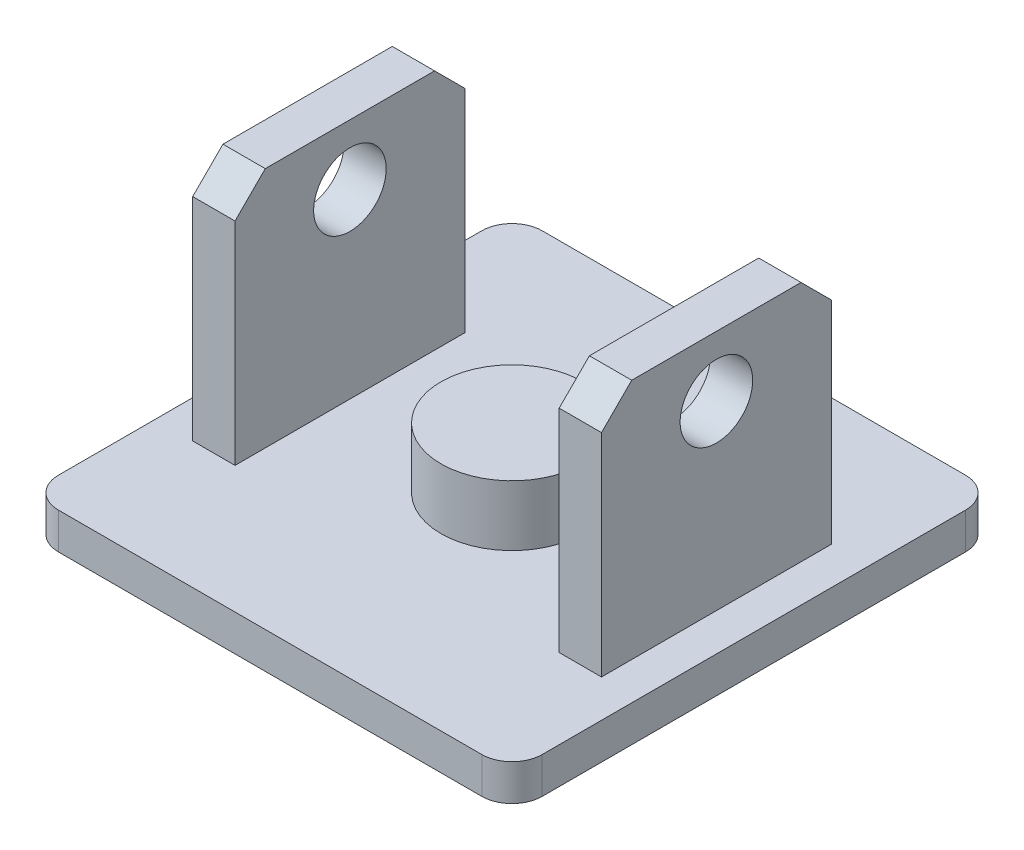
ISO-10303-21;
HEADER;
FILE_DESCRIPTION(('STEP AP214'),'2;1');
FILE_NAME('part.step','',(''),(''),'','','');
FILE_SCHEMA(('AUTOMOTIVE_DESIGN { 1 0 10303 214 1 1 1 1 }'));
ENDSEC;
DATA;
#1=APPLICATION_CONTEXT('core data for automotive mechanical design processes');
#2=APPLICATION_PROTOCOL_DEFINITION('international standard','automotive_design',2000,#1);
#3=PRODUCT_CONTEXT('',#1,'mechanical');
#4=PRODUCT('Part','Part','',(#3));
#5=PRODUCT_RELATED_PRODUCT_CATEGORY('part','',(#4));
#6=PRODUCT_DEFINITION_FORMATION('','',#4);
#7=PRODUCT_DEFINITION_CONTEXT('part definition',#1,'design');
#8=PRODUCT_DEFINITION('design','',#6,#7);
#9=PRODUCT_DEFINITION_SHAPE('','',#8);
#10=(LENGTH_UNIT() NAMED_UNIT(*) SI_UNIT(.MILLI.,.METRE.));
#11=(NAMED_UNIT(*) PLANE_ANGLE_UNIT() SI_UNIT($,.RADIAN.));
#12=(NAMED_UNIT(*) SI_UNIT($,.STERADIAN.) SOLID_ANGLE_UNIT());
#13=UNCERTAINTY_MEASURE_WITH_UNIT(LENGTH_MEASURE(1.E-05),#10,'distance_accuracy_value','');
#14=(GEOMETRIC_REPRESENTATION_CONTEXT(3) GLOBAL_UNCERTAINTY_ASSIGNED_CONTEXT((#13)) GLOBAL_UNIT_ASSIGNED_CONTEXT((#10,
#11,#12)) REPRESENTATION_CONTEXT('',''));
#15=CARTESIAN_POINT('',(0.,0.,0.));
#16=DIRECTION('',(0.,0.,1.));
#17=DIRECTION('',(1.,0.,0.));
#18=AXIS2_PLACEMENT_3D('',#15,#16,#17);
#19=CARTESIAN_POINT('',(0.,3.,0.));
#20=DIRECTION('',(0.,1.,0.));
#21=DIRECTION('',(0.,0.,1.));
#22=AXIS2_PLACEMENT_3D('',#19,#20,#21);
#23=PLANE('',#22);
#24=DIRECTION('',(0.,0.,-1.));
#25=VECTOR('',#24,1.);
#26=CARTESIAN_POINT('',(-16.9,3.,-9.5));
#27=LINE('',#26,#25);
#28=CARTESIAN_POINT('',(-16.9,3.,9.5));
#29=VERTEX_POINT('',#28);
#30=CARTESIAN_POINT('',(-16.9,3.,-9.5));
#31=VERTEX_POINT('',#30);
#32=EDGE_CURVE('E183',#29,#31,#27,.T.);
#33=ORIENTED_EDGE('',*,*,#32,.T.);
#34=DIRECTION('',(1.,0.,0.));
#35=VECTOR('',#34,1.);
#36=CARTESIAN_POINT('',(-13.4,3.,-9.5));
#37=LINE('',#36,#35);
#38=CARTESIAN_POINT('',(-13.4,3.,-9.5));
#39=VERTEX_POINT('',#38);
#40=EDGE_CURVE('E199',#31,#39,#37,.T.);
#41=ORIENTED_EDGE('',*,*,#40,.T.);
#42=DIRECTION('',(0.,0.,1.));
#43=VECTOR('',#42,1.);
#44=CARTESIAN_POINT('',(-13.4,3.,-9.5));
#45=LINE('',#44,#43);
#46=CARTESIAN_POINT('',(-13.4,3.,9.5));
#47=VERTEX_POINT('',#46);
#48=EDGE_CURVE('E208',#39,#47,#45,.T.);
#49=ORIENTED_EDGE('',*,*,#48,.T.);
#50=DIRECTION('',(-1.,0.,0.));
#51=VECTOR('',#50,1.);
#52=CARTESIAN_POINT('',(-13.4,3.,9.5));
#53=LINE('',#52,#51);
#54=EDGE_CURVE('E202',#47,#29,#53,.T.);
#55=ORIENTED_EDGE('',*,*,#54,.T.);
#56=EDGE_LOOP('',(#33,#41,#49,#55));
#57=FACE_BOUND('',#56,.T.);
#58=CARTESIAN_POINT('',(0.,3.,0.));
#59=DIRECTION('',(0.,1.,0.));
#60=DIRECTION('',(0.,0.,1.));
#61=AXIS2_PLACEMENT_3D('',#58,#59,#60);
#62=CIRCLE('',#61,5.875);
#63=CARTESIAN_POINT('',(0.,3.,5.875));
#64=VERTEX_POINT('',#63);
#65=EDGE_CURVE('E255',#64,#64,#62,.T.);
#66=ORIENTED_EDGE('',*,*,#65,.F.);
#67=EDGE_LOOP('',(#66));
#68=FACE_BOUND('',#67,.T.);
#69=DIRECTION('',(1.,0.,0.));
#70=VECTOR('',#69,1.);
#71=CARTESIAN_POINT('',(-20.,3.,20.));
#72=LINE('',#71,#70);
#73=CARTESIAN_POINT('',(-17.5,3.,20.));
#74=VERTEX_POINT('',#73);
#75=CARTESIAN_POINT('',(17.5,3.,20.));
#76=VERTEX_POINT('',#75);
#77=EDGE_CURVE('E259',#74,#76,#72,.T.);
#78=ORIENTED_EDGE('',*,*,#77,.T.);
#79=CARTESIAN_POINT('',(17.5,3.,17.5));
#80=DIRECTION('',(0.,1.,0.));
#81=DIRECTION('',(0.,0.,1.));
#82=AXIS2_PLACEMENT_3D('',#79,#80,#81);
#83=CIRCLE('',#82,2.5);
#84=CARTESIAN_POINT('',(20.,3.,17.5));
#85=VERTEX_POINT('',#84);
#86=EDGE_CURVE('E305',#76,#85,#83,.T.);
#87=ORIENTED_EDGE('',*,*,#86,.T.);
#88=DIRECTION('',(0.,0.,-1.));
#89=VECTOR('',#88,1.);
#90=CARTESIAN_POINT('',(20.,3.,-20.));
#91=LINE('',#90,#89);
#92=CARTESIAN_POINT('',(20.,3.,-17.5));
#93=VERTEX_POINT('',#92);
#94=EDGE_CURVE('E260',#85,#93,#91,.T.);
#95=ORIENTED_EDGE('',*,*,#94,.T.);
#96=CARTESIAN_POINT('',(17.5,3.,-17.5));
#97=DIRECTION('',(0.,1.,0.));
#98=DIRECTION('',(0.,0.,1.));
#99=AXIS2_PLACEMENT_3D('',#96,#97,#98);
#100=CIRCLE('',#99,2.5);
#101=CARTESIAN_POINT('',(17.5,3.,-20.));
#102=VERTEX_POINT('',#101);
#103=EDGE_CURVE('E303',#93,#102,#100,.T.);
#104=ORIENTED_EDGE('',*,*,#103,.T.);
#105=DIRECTION('',(-1.,0.,0.));
#106=VECTOR('',#105,1.);
#107=CARTESIAN_POINT('',(-20.,3.,-20.));
#108=LINE('',#107,#106);
#109=CARTESIAN_POINT('',(-17.5,3.,-20.));
#110=VERTEX_POINT('',#109);
#111=EDGE_CURVE('E263',#102,#110,#108,.T.);
#112=ORIENTED_EDGE('',*,*,#111,.T.);
#113=CARTESIAN_POINT('',(-17.5,3.,-17.5));
#114=DIRECTION('',(0.,1.,0.));
#115=DIRECTION('',(0.,0.,1.));
#116=AXIS2_PLACEMENT_3D('',#113,#114,#115);
#117=CIRCLE('',#116,2.5);
#118=CARTESIAN_POINT('',(-20.,3.,-17.5));
#119=VERTEX_POINT('',#118);
#120=EDGE_CURVE('E299',#110,#119,#117,.T.);
#121=ORIENTED_EDGE('',*,*,#120,.T.);
#122=DIRECTION('',(0.,0.,1.));
#123=VECTOR('',#122,1.);
#124=CARTESIAN_POINT('',(-20.,3.,-20.));
#125=LINE('',#124,#123);
#126=CARTESIAN_POINT('',(-20.,3.,17.5));
#127=VERTEX_POINT('',#126);
#128=EDGE_CURVE('E267',#119,#127,#125,.T.);
#129=ORIENTED_EDGE('',*,*,#128,.T.);
#130=CARTESIAN_POINT('',(-17.5,3.,17.5));
#131=DIRECTION('',(0.,1.,0.));
#132=DIRECTION('',(0.,0.,1.));
#133=AXIS2_PLACEMENT_3D('',#130,#131,#132);
#134=CIRCLE('',#133,2.5);
#135=EDGE_CURVE('E301',#127,#74,#134,.T.);
#136=ORIENTED_EDGE('',*,*,#135,.T.);
#137=EDGE_LOOP('',(#78,#87,#95,#104,#112,#121,#129,#136));
#138=FACE_BOUND('',#137,.T.);
#139=DIRECTION('',(-1.,0.,0.));
#140=VECTOR('',#139,1.);
#141=CARTESIAN_POINT('',(13.4,3.,-9.5));
#142=LINE('',#141,#140);
#143=CARTESIAN_POINT('',(16.9,3.,-9.5));
#144=VERTEX_POINT('',#143);
#145=CARTESIAN_POINT('',(13.4,3.,-9.5));
#146=VERTEX_POINT('',#145);
#147=EDGE_CURVE('E236',#144,#146,#142,.T.);
#148=ORIENTED_EDGE('',*,*,#147,.F.);
#149=DIRECTION('',(0.,0.,-1.));
#150=VECTOR('',#149,1.);
#151=CARTESIAN_POINT('',(16.9,3.,-9.5));
#152=LINE('',#151,#150);
#153=CARTESIAN_POINT('',(16.9,3.,9.5));
#154=VERTEX_POINT('',#153);
#155=EDGE_CURVE('E225',#154,#144,#152,.T.);
#156=ORIENTED_EDGE('',*,*,#155,.F.);
#157=DIRECTION('',(1.,0.,0.));
#158=VECTOR('',#157,1.);
#159=CARTESIAN_POINT('',(13.4,3.,9.5));
#160=LINE('',#159,#158);
#161=CARTESIAN_POINT('',(13.4,3.,9.5));
#162=VERTEX_POINT('',#161);
#163=EDGE_CURVE('E230',#162,#154,#160,.T.);
#164=ORIENTED_EDGE('',*,*,#163,.F.);
#165=DIRECTION('',(0.,0.,1.));
#166=VECTOR('',#165,1.);
#167=CARTESIAN_POINT('',(13.4,3.,-9.5));
#168=LINE('',#167,#166);
#169=EDGE_CURVE('E239',#146,#162,#168,.T.);
#170=ORIENTED_EDGE('',*,*,#169,.F.);
#171=EDGE_LOOP('',(#148,#156,#164,#170));
#172=FACE_BOUND('',#171,.T.);
#173=ADVANCED_FACE('F41',(#57,#68,#138,#172),#23,.T.);
#174=CARTESIAN_POINT('',(20.,3.,-20.));
#175=DIRECTION('',(-1.,0.,0.));
#176=DIRECTION('',(0.,0.,1.));
#177=AXIS2_PLACEMENT_3D('',#174,#175,#176);
#178=PLANE('',#177);
#179=ORIENTED_EDGE('',*,*,#94,.F.);
#180=DIRECTION('',(0.,-1.,0.));
#181=VECTOR('',#180,1.);
#182=CARTESIAN_POINT('',(20.,3.,17.5));
#183=LINE('',#182,#181);
#184=CARTESIAN_POINT('',(20.,0.,17.5));
#185=VERTEX_POINT('',#184);
#186=EDGE_CURVE('E283',#85,#185,#183,.T.);
#187=ORIENTED_EDGE('',*,*,#186,.T.);
#188=DIRECTION('',(0.,0.,-1.));
#189=VECTOR('',#188,1.);
#190=CARTESIAN_POINT('',(20.,0.,-20.));
#191=LINE('',#190,#189);
#192=CARTESIAN_POINT('',(20.,0.,-17.5));
#193=VERTEX_POINT('',#192);
#194=EDGE_CURVE('E254',#185,#193,#191,.T.);
#195=ORIENTED_EDGE('',*,*,#194,.T.);
#196=DIRECTION('',(0.,-1.,0.));
#197=VECTOR('',#196,1.);
#198=CARTESIAN_POINT('',(20.,3.,-17.5));
#199=LINE('',#198,#197);
#200=EDGE_CURVE('E258',#193,#93,#199,.F.);
#201=ORIENTED_EDGE('',*,*,#200,.T.);
#202=EDGE_LOOP('',(#179,#187,#195,#201));
#203=FACE_BOUND('',#202,.T.);
#204=ADVANCED_FACE('F379',(#203),#178,.F.);
#205=CARTESIAN_POINT('',(-20.,3.,-20.));
#206=DIRECTION('',(0.,0.,1.));
#207=DIRECTION('',(1.,0.,0.));
#208=AXIS2_PLACEMENT_3D('',#205,#206,#207);
#209=PLANE('',#208);
#210=ORIENTED_EDGE('',*,*,#111,.F.);
#211=DIRECTION('',(0.,-1.,0.));
#212=VECTOR('',#211,1.);
#213=CARTESIAN_POINT('',(17.5,3.,-20.));
#214=LINE('',#213,#212);
#215=CARTESIAN_POINT('',(17.5,0.,-20.));
#216=VERTEX_POINT('',#215);
#217=EDGE_CURVE('E309',#102,#216,#214,.T.);
#218=ORIENTED_EDGE('',*,*,#217,.T.);
#219=DIRECTION('',(-1.,0.,0.));
#220=VECTOR('',#219,1.);
#221=CARTESIAN_POINT('',(-20.,0.,-20.));
#222=LINE('',#221,#220);
#223=CARTESIAN_POINT('',(-17.5,0.,-20.));
#224=VERTEX_POINT('',#223);
#225=EDGE_CURVE('E274',#216,#224,#222,.T.);
#226=ORIENTED_EDGE('',*,*,#225,.T.);
#227=DIRECTION('',(0.,-1.,0.));
#228=VECTOR('',#227,1.);
#229=CARTESIAN_POINT('',(-17.5,3.,-20.));
#230=LINE('',#229,#228);
#231=EDGE_CURVE('E307',#224,#110,#230,.F.);
#232=ORIENTED_EDGE('',*,*,#231,.T.);
#233=EDGE_LOOP('',(#210,#218,#226,#232));
#234=FACE_BOUND('',#233,.T.);
#235=ADVANCED_FACE('F386',(#234),#209,.F.);
#236=CARTESIAN_POINT('',(-20.,3.,-20.));
#237=DIRECTION('',(1.,0.,0.));
#238=DIRECTION('',(0.,0.,-1.));
#239=AXIS2_PLACEMENT_3D('',#236,#237,#238);
#240=PLANE('',#239);
#241=DIRECTION('',(0.,0.,1.));
#242=VECTOR('',#241,1.);
#243=CARTESIAN_POINT('',(-20.,0.,-20.));
#244=LINE('',#243,#242);
#245=CARTESIAN_POINT('',(-20.,0.,-17.5));
#246=VERTEX_POINT('',#245);
#247=CARTESIAN_POINT('',(-20.,0.,17.5));
#248=VERTEX_POINT('',#247);
#249=EDGE_CURVE('E277',#246,#248,#244,.T.);
#250=ORIENTED_EDGE('',*,*,#249,.T.);
#251=DIRECTION('',(0.,-1.,0.));
#252=VECTOR('',#251,1.);
#253=CARTESIAN_POINT('',(-20.,3.,17.5));
#254=LINE('',#253,#252);
#255=EDGE_CURVE('E315',#248,#127,#254,.F.);
#256=ORIENTED_EDGE('',*,*,#255,.T.);
#257=ORIENTED_EDGE('',*,*,#128,.F.);
#258=DIRECTION('',(0.,-1.,0.));
#259=VECTOR('',#258,1.);
#260=CARTESIAN_POINT('',(-20.,3.,-17.5));
#261=LINE('',#260,#259);
#262=EDGE_CURVE('E312',#119,#246,#261,.T.);
#263=ORIENTED_EDGE('',*,*,#262,.T.);
#264=EDGE_LOOP('',(#250,#256,#257,#263));
#265=FACE_BOUND('',#264,.T.);
#266=ADVANCED_FACE('F400',(#265),#240,.F.);
#267=CARTESIAN_POINT('',(-20.,3.,20.));
#268=DIRECTION('',(0.,0.,-1.));
#269=DIRECTION('',(-1.,0.,0.));
#270=AXIS2_PLACEMENT_3D('',#267,#268,#269);
#271=PLANE('',#270);
#272=DIRECTION('',(1.,0.,0.));
#273=VECTOR('',#272,1.);
#274=CARTESIAN_POINT('',(-20.,0.,20.));
#275=LINE('',#274,#273);
#276=CARTESIAN_POINT('',(-17.5,0.,20.));
#277=VERTEX_POINT('',#276);
#278=CARTESIAN_POINT('',(17.5,0.,20.));
#279=VERTEX_POINT('',#278);
#280=EDGE_CURVE('E264',#277,#279,#275,.T.);
#281=ORIENTED_EDGE('',*,*,#280,.T.);
#282=DIRECTION('',(0.,-1.,0.));
#283=VECTOR('',#282,1.);
#284=CARTESIAN_POINT('',(17.5,3.,20.));
#285=LINE('',#284,#283);
#286=EDGE_CURVE('E297',#279,#76,#285,.F.);
#287=ORIENTED_EDGE('',*,*,#286,.T.);
#288=ORIENTED_EDGE('',*,*,#77,.F.);
#289=DIRECTION('',(0.,-1.,0.));
#290=VECTOR('',#289,1.);
#291=CARTESIAN_POINT('',(-17.5,3.,20.));
#292=LINE('',#291,#290);
#293=EDGE_CURVE('E294',#74,#277,#292,.T.);
#294=ORIENTED_EDGE('',*,*,#293,.T.);
#295=EDGE_LOOP('',(#281,#287,#288,#294));
#296=FACE_BOUND('',#295,.T.);
#297=ADVANCED_FACE('F396',(#296),#271,.F.);
#298=CARTESIAN_POINT('',(0.,0.,0.));
#299=DIRECTION('',(0.,1.,0.));
#300=DIRECTION('',(0.,0.,1.));
#301=AXIS2_PLACEMENT_3D('',#298,#299,#300);
#302=PLANE('',#301);
#303=ORIENTED_EDGE('',*,*,#194,.F.);
#304=CARTESIAN_POINT('',(17.5,0.,17.5));
#305=DIRECTION('',(0.,1.,0.));
#306=DIRECTION('',(0.,0.,1.));
#307=AXIS2_PLACEMENT_3D('',#304,#305,#306);
#308=CIRCLE('',#307,2.5);
#309=EDGE_CURVE('E292',#185,#279,#308,.F.);
#310=ORIENTED_EDGE('',*,*,#309,.T.);
#311=ORIENTED_EDGE('',*,*,#280,.F.);
#312=CARTESIAN_POINT('',(-17.5,0.,17.5));
#313=DIRECTION('',(0.,1.,0.));
#314=DIRECTION('',(0.,0.,1.));
#315=AXIS2_PLACEMENT_3D('',#312,#313,#314);
#316=CIRCLE('',#315,2.5);
#317=EDGE_CURVE('E288',#277,#248,#316,.F.);
#318=ORIENTED_EDGE('',*,*,#317,.T.);
#319=ORIENTED_EDGE('',*,*,#249,.F.);
#320=CARTESIAN_POINT('',(-17.5,0.,-17.5));
#321=DIRECTION('',(0.,1.,0.));
#322=DIRECTION('',(0.,0.,1.));
#323=AXIS2_PLACEMENT_3D('',#320,#321,#322);
#324=CIRCLE('',#323,2.5);
#325=EDGE_CURVE('E286',#246,#224,#324,.F.);
#326=ORIENTED_EDGE('',*,*,#325,.T.);
#327=ORIENTED_EDGE('',*,*,#225,.F.);
#328=CARTESIAN_POINT('',(17.5,0.,-17.5));
#329=DIRECTION('',(0.,1.,0.));
#330=DIRECTION('',(0.,0.,1.));
#331=AXIS2_PLACEMENT_3D('',#328,#329,#330);
#332=CIRCLE('',#331,2.5);
#333=EDGE_CURVE('E290',#216,#193,#332,.F.);
#334=ORIENTED_EDGE('',*,*,#333,.T.);
#335=EDGE_LOOP('',(#303,#310,#311,#318,#319,#326,#327,#334));
#336=FACE_BOUND('',#335,.T.);
#337=ADVANCED_FACE('F393',(#336),#302,.F.);
#338=CARTESIAN_POINT('',(0.,8.,0.));
#339=DIRECTION('',(0.,-1.,0.));
#340=DIRECTION('',(0.,0.,-1.));
#341=AXIS2_PLACEMENT_3D('',#338,#339,#340);
#342=CYLINDRICAL_SURFACE('',#341,5.875);
#343=CARTESIAN_POINT('',(0.,8.,0.));
#344=DIRECTION('',(0.,1.,0.));
#345=DIRECTION('',(0.,0.,1.));
#346=AXIS2_PLACEMENT_3D('',#343,#344,#345);
#347=CIRCLE('',#346,5.875);
#348=CARTESIAN_POINT('',(0.,8.,5.875));
#349=VERTEX_POINT('',#348);
#350=EDGE_CURVE('E251',#349,#349,#347,.T.);
#351=ORIENTED_EDGE('',*,*,#350,.F.);
#352=EDGE_LOOP('',(#351));
#353=FACE_BOUND('',#352,.T.);
#354=ORIENTED_EDGE('',*,*,#65,.T.);
#355=EDGE_LOOP('',(#354));
#356=FACE_BOUND('',#355,.T.);
#357=ADVANCED_FACE('F391',(#353,#356),#342,.T.);
#358=CARTESIAN_POINT('',(0.,8.,0.));
#359=DIRECTION('',(0.,1.,0.));
#360=DIRECTION('',(0.,0.,1.));
#361=AXIS2_PLACEMENT_3D('',#358,#359,#360);
#362=PLANE('',#361);
#363=ORIENTED_EDGE('',*,*,#350,.T.);
#364=EDGE_LOOP('',(#363));
#365=FACE_BOUND('',#364,.T.);
#366=ADVANCED_FACE('F375',(#365),#362,.T.);
#367=CARTESIAN_POINT('',(16.9,23.,-9.5));
#368=DIRECTION('',(-1.,0.,0.));
#369=DIRECTION('',(0.,0.,1.));
#370=AXIS2_PLACEMENT_3D('',#367,#368,#369);
#371=PLANE('',#370);
#372=CARTESIAN_POINT('',(16.9,18.,0.));
#373=DIRECTION('',(1.,0.,0.));
#374=DIRECTION('',(0.,0.,-1.));
#375=AXIS2_PLACEMENT_3D('',#372,#373,#374);
#376=CIRCLE('',#375,3.);
#377=CARTESIAN_POINT('',(16.9,18.,-3.));
#378=VERTEX_POINT('',#377);
#379=EDGE_CURVE('E219',#378,#378,#376,.T.);
#380=ORIENTED_EDGE('',*,*,#379,.F.);
#381=EDGE_LOOP('',(#380));
#382=FACE_BOUND('',#381,.T.);
#383=DIRECTION('',(0.,0.,-1.));
#384=VECTOR('',#383,1.);
#385=CARTESIAN_POINT('',(16.9,23.,-9.5));
#386=LINE('',#385,#384);
#387=CARTESIAN_POINT('',(16.9,23.,7.));
#388=VERTEX_POINT('',#387);
#389=CARTESIAN_POINT('',(16.9,23.,-6.99999999999999));
#390=VERTEX_POINT('',#389);
#391=EDGE_CURVE('E226',#388,#390,#386,.T.);
#392=ORIENTED_EDGE('',*,*,#391,.F.);
#393=DIRECTION('',(0.,-0.707106781186549,0.707106781186546));
#394=VECTOR('',#393,1.);
#395=CARTESIAN_POINT('',(16.9,23.,7.));
#396=LINE('',#395,#394);
#397=CARTESIAN_POINT('',(16.9,20.5,9.5));
#398=VERTEX_POINT('',#397);
#399=EDGE_CURVE('E341',#388,#398,#396,.T.);
#400=ORIENTED_EDGE('',*,*,#399,.T.);
#401=DIRECTION('',(0.,-1.,0.));
#402=VECTOR('',#401,1.);
#403=CARTESIAN_POINT('',(16.9,23.,9.5));
#404=LINE('',#403,#402);
#405=EDGE_CURVE('E233',#398,#154,#404,.T.);
#406=ORIENTED_EDGE('',*,*,#405,.T.);
#407=ORIENTED_EDGE('',*,*,#155,.T.);
#408=DIRECTION('',(0.,-1.,0.));
#409=VECTOR('',#408,1.);
#410=CARTESIAN_POINT('',(16.9,23.,-9.5));
#411=LINE('',#410,#409);
#412=CARTESIAN_POINT('',(16.9,20.5,-9.5));
#413=VERTEX_POINT('',#412);
#414=EDGE_CURVE('E249',#413,#144,#411,.T.);
#415=ORIENTED_EDGE('',*,*,#414,.F.);
#416=DIRECTION('',(0.,0.707106781186549,0.707106781186547));
#417=VECTOR('',#416,1.);
#418=CARTESIAN_POINT('',(16.9,23.,-6.99999999999999));
#419=LINE('',#418,#417);
#420=EDGE_CURVE('E339',#413,#390,#419,.T.);
#421=ORIENTED_EDGE('',*,*,#420,.T.);
#422=EDGE_LOOP('',(#392,#400,#406,#407,#415,#421));
#423=FACE_BOUND('',#422,.T.);
#424=ADVANCED_FACE('F354',(#382,#423),#371,.F.);
#425=CARTESIAN_POINT('',(13.4,23.,-9.5));
#426=DIRECTION('',(0.,0.,1.));
#427=DIRECTION('',(1.,0.,0.));
#428=AXIS2_PLACEMENT_3D('',#425,#426,#427);
#429=PLANE('',#428);
#430=DIRECTION('',(0.,-1.,0.));
#431=VECTOR('',#430,1.);
#432=CARTESIAN_POINT('',(13.4,23.,-9.5));
#433=LINE('',#432,#431);
#434=CARTESIAN_POINT('',(13.4,20.5,-9.5));
#435=VERTEX_POINT('',#434);
#436=EDGE_CURVE('E247',#435,#146,#433,.T.);
#437=ORIENTED_EDGE('',*,*,#436,.F.);
#438=DIRECTION('',(1.,0.,0.));
#439=VECTOR('',#438,1.);
#440=CARTESIAN_POINT('',(16.9,20.5,-9.5));
#441=LINE('',#440,#439);
#442=EDGE_CURVE('E11',#435,#413,#441,.T.);
#443=ORIENTED_EDGE('',*,*,#442,.T.);
#444=ORIENTED_EDGE('',*,*,#414,.T.);
#445=ORIENTED_EDGE('',*,*,#147,.T.);
#446=EDGE_LOOP('',(#437,#443,#444,#445));
#447=FACE_BOUND('',#446,.T.);
#448=ADVANCED_FACE('F366',(#447),#429,.F.);
#449=CARTESIAN_POINT('',(13.4,23.,-9.5));
#450=DIRECTION('',(1.,0.,0.));
#451=DIRECTION('',(0.,0.,-1.));
#452=AXIS2_PLACEMENT_3D('',#449,#450,#451);
#453=PLANE('',#452);
#454=CARTESIAN_POINT('',(13.4,18.,0.));
#455=DIRECTION('',(1.,0.,0.));
#456=DIRECTION('',(0.,0.,-1.));
#457=AXIS2_PLACEMENT_3D('',#454,#455,#456);
#458=CIRCLE('',#457,3.);
#459=CARTESIAN_POINT('',(13.4,18.,-3.));
#460=VERTEX_POINT('',#459);
#461=EDGE_CURVE('E222',#460,#460,#458,.F.);
#462=ORIENTED_EDGE('',*,*,#461,.F.);
#463=EDGE_LOOP('',(#462));
#464=FACE_BOUND('',#463,.T.);
#465=DIRECTION('',(0.,-1.,0.));
#466=VECTOR('',#465,1.);
#467=CARTESIAN_POINT('',(13.4,23.,9.5));
#468=LINE('',#467,#466);
#469=CARTESIAN_POINT('',(13.4,20.5,9.5));
#470=VERTEX_POINT('',#469);
#471=EDGE_CURVE('E245',#470,#162,#468,.T.);
#472=ORIENTED_EDGE('',*,*,#471,.F.);
#473=DIRECTION('',(0.,0.707106781186549,-0.707106781186546));
#474=VECTOR('',#473,1.);
#475=CARTESIAN_POINT('',(13.4,23.,7.));
#476=LINE('',#475,#474);
#477=CARTESIAN_POINT('',(13.4,23.,7.));
#478=VERTEX_POINT('',#477);
#479=EDGE_CURVE('E50',#470,#478,#476,.T.);
#480=ORIENTED_EDGE('',*,*,#479,.T.);
#481=DIRECTION('',(0.,0.,1.));
#482=VECTOR('',#481,1.);
#483=CARTESIAN_POINT('',(13.4,23.,-9.5));
#484=LINE('',#483,#482);
#485=CARTESIAN_POINT('',(13.4,23.,-6.99999999999999));
#486=VERTEX_POINT('',#485);
#487=EDGE_CURVE('E229',#486,#478,#484,.T.);
#488=ORIENTED_EDGE('',*,*,#487,.F.);
#489=DIRECTION('',(0.,-0.707106781186549,-0.707106781186547));
#490=VECTOR('',#489,1.);
#491=CARTESIAN_POINT('',(13.4,23.,-6.99999999999999));
#492=LINE('',#491,#490);
#493=EDGE_CURVE('E57',#486,#435,#492,.T.);
#494=ORIENTED_EDGE('',*,*,#493,.T.);
#495=ORIENTED_EDGE('',*,*,#436,.T.);
#496=ORIENTED_EDGE('',*,*,#169,.T.);
#497=EDGE_LOOP('',(#472,#480,#488,#494,#495,#496));
#498=FACE_BOUND('',#497,.T.);
#499=ADVANCED_FACE('F345',(#464,#498),#453,.F.);
#500=CARTESIAN_POINT('',(13.4,23.,9.5));
#501=DIRECTION('',(0.,0.,-1.));
#502=DIRECTION('',(-1.,0.,0.));
#503=AXIS2_PLACEMENT_3D('',#500,#501,#502);
#504=PLANE('',#503);
#505=ORIENTED_EDGE('',*,*,#405,.F.);
#506=DIRECTION('',(-1.,0.,0.));
#507=VECTOR('',#506,1.);
#508=CARTESIAN_POINT('',(13.4,20.5,9.5));
#509=LINE('',#508,#507);
#510=EDGE_CURVE('E65',#398,#470,#509,.T.);
#511=ORIENTED_EDGE('',*,*,#510,.T.);
#512=ORIENTED_EDGE('',*,*,#471,.T.);
#513=ORIENTED_EDGE('',*,*,#163,.T.);
#514=EDGE_LOOP('',(#505,#511,#512,#513));
#515=FACE_BOUND('',#514,.T.);
#516=ADVANCED_FACE('F355',(#515),#504,.F.);
#517=CARTESIAN_POINT('',(0.,23.,0.));
#518=DIRECTION('',(0.,1.,0.));
#519=DIRECTION('',(0.,0.,1.));
#520=AXIS2_PLACEMENT_3D('',#517,#518,#519);
#521=PLANE('',#520);
#522=ORIENTED_EDGE('',*,*,#487,.T.);
#523=DIRECTION('',(1.,0.,0.));
#524=VECTOR('',#523,1.);
#525=CARTESIAN_POINT('',(16.9,23.,7.));
#526=LINE('',#525,#524);
#527=EDGE_CURVE('E336',#478,#388,#526,.T.);
#528=ORIENTED_EDGE('',*,*,#527,.T.);
#529=ORIENTED_EDGE('',*,*,#391,.T.);
#530=DIRECTION('',(-1.,0.,0.));
#531=VECTOR('',#530,1.);
#532=CARTESIAN_POINT('',(13.4,23.,-6.99999999999999));
#533=LINE('',#532,#531);
#534=EDGE_CURVE('E333',#390,#486,#533,.T.);
#535=ORIENTED_EDGE('',*,*,#534,.T.);
#536=EDGE_LOOP('',(#522,#528,#529,#535));
#537=FACE_BOUND('',#536,.T.);
#538=ADVANCED_FACE('F349',(#537),#521,.T.);
#539=CARTESIAN_POINT('',(-20.001,18.,0.));
#540=DIRECTION('',(1.,0.,0.));
#541=DIRECTION('',(0.,0.,-1.));
#542=AXIS2_PLACEMENT_3D('',#539,#540,#541);
#543=CYLINDRICAL_SURFACE('',#542,3.);
#544=ORIENTED_EDGE('',*,*,#379,.T.);
#545=EDGE_LOOP('',(#544));
#546=FACE_BOUND('',#545,.T.);
#547=ORIENTED_EDGE('',*,*,#461,.T.);
#548=EDGE_LOOP('',(#547));
#549=FACE_BOUND('',#548,.T.);
#550=ADVANCED_FACE('F412',(#546,#549),#543,.F.);
#551=CARTESIAN_POINT('',(17.5,3.,17.5));
#552=DIRECTION('',(0.,-1.,0.));
#553=DIRECTION('',(0.,0.,-1.));
#554=AXIS2_PLACEMENT_3D('',#551,#552,#553);
#555=CYLINDRICAL_SURFACE('',#554,2.5);
#556=ORIENTED_EDGE('',*,*,#86,.F.);
#557=ORIENTED_EDGE('',*,*,#286,.F.);
#558=ORIENTED_EDGE('',*,*,#309,.F.);
#559=ORIENTED_EDGE('',*,*,#186,.F.);
#560=EDGE_LOOP('',(#556,#557,#558,#559));
#561=FACE_BOUND('',#560,.T.);
#562=ADVANCED_FACE('F408',(#561),#555,.T.);
#563=CARTESIAN_POINT('',(17.5,3.,-17.5));
#564=DIRECTION('',(0.,-1.,0.));
#565=DIRECTION('',(0.,0.,-1.));
#566=AXIS2_PLACEMENT_3D('',#563,#564,#565);
#567=CYLINDRICAL_SURFACE('',#566,2.5);
#568=ORIENTED_EDGE('',*,*,#103,.F.);
#569=ORIENTED_EDGE('',*,*,#200,.F.);
#570=ORIENTED_EDGE('',*,*,#333,.F.);
#571=ORIENTED_EDGE('',*,*,#217,.F.);
#572=EDGE_LOOP('',(#568,#569,#570,#571));
#573=FACE_BOUND('',#572,.T.);
#574=ADVANCED_FACE('F411',(#573),#567,.T.);
#575=CARTESIAN_POINT('',(-17.5,3.,17.5));
#576=DIRECTION('',(0.,-1.,0.));
#577=DIRECTION('',(0.,0.,-1.));
#578=AXIS2_PLACEMENT_3D('',#575,#576,#577);
#579=CYLINDRICAL_SURFACE('',#578,2.5);
#580=ORIENTED_EDGE('',*,*,#135,.F.);
#581=ORIENTED_EDGE('',*,*,#255,.F.);
#582=ORIENTED_EDGE('',*,*,#317,.F.);
#583=ORIENTED_EDGE('',*,*,#293,.F.);
#584=EDGE_LOOP('',(#580,#581,#582,#583));
#585=FACE_BOUND('',#584,.T.);
#586=ADVANCED_FACE('F416',(#585),#579,.T.);
#587=CARTESIAN_POINT('',(-17.5,3.,-17.5));
#588=DIRECTION('',(0.,-1.,0.));
#589=DIRECTION('',(0.,0.,-1.));
#590=AXIS2_PLACEMENT_3D('',#587,#588,#589);
#591=CYLINDRICAL_SURFACE('',#590,2.5);
#592=ORIENTED_EDGE('',*,*,#120,.F.);
#593=ORIENTED_EDGE('',*,*,#231,.F.);
#594=ORIENTED_EDGE('',*,*,#325,.F.);
#595=ORIENTED_EDGE('',*,*,#262,.F.);
#596=EDGE_LOOP('',(#592,#593,#594,#595));
#597=FACE_BOUND('',#596,.T.);
#598=ADVANCED_FACE('F420',(#597),#591,.T.);
#599=CARTESIAN_POINT('',(-16.9,23.,-9.5));
#600=DIRECTION('',(-1.,0.,0.));
#601=DIRECTION('',(0.,0.,1.));
#602=AXIS2_PLACEMENT_3D('',#599,#600,#601);
#603=PLANE('',#602);
#604=CARTESIAN_POINT('',(-16.9,18.,0.));
#605=DIRECTION('',(1.,0.,0.));
#606=DIRECTION('',(0.,0.,-1.));
#607=AXIS2_PLACEMENT_3D('',#604,#605,#606);
#608=CIRCLE('',#607,3.);
#609=CARTESIAN_POINT('',(-16.9,18.,-3.));
#610=VERTEX_POINT('',#609);
#611=EDGE_CURVE('E666',#610,#610,#608,.T.);
#612=ORIENTED_EDGE('',*,*,#611,.T.);
#613=EDGE_LOOP('',(#612));
#614=FACE_BOUND('',#613,.T.);
#615=DIRECTION('',(0.,-1.,0.));
#616=VECTOR('',#615,1.);
#617=CARTESIAN_POINT('',(-16.9,23.,9.5));
#618=LINE('',#617,#616);
#619=CARTESIAN_POINT('',(-16.9,20.5,9.5));
#620=VERTEX_POINT('',#619);
#621=EDGE_CURVE('E217',#620,#29,#618,.T.);
#622=ORIENTED_EDGE('',*,*,#621,.F.);
#623=DIRECTION('',(0.,-0.707106781186547,0.707106781186549));
#624=VECTOR('',#623,1.);
#625=CARTESIAN_POINT('',(-16.9,31.25,-1.25000000000003));
#626=LINE('',#625,#624);
#627=CARTESIAN_POINT('',(-16.9,23.,6.99999999999999));
#628=VERTEX_POINT('',#627);
#629=EDGE_CURVE('E321',#620,#628,#626,.F.);
#630=ORIENTED_EDGE('',*,*,#629,.T.);
#631=DIRECTION('',(0.,0.,-1.));
#632=VECTOR('',#631,1.);
#633=CARTESIAN_POINT('',(-16.9,23.,-9.5));
#634=LINE('',#633,#632);
#635=CARTESIAN_POINT('',(-16.9,23.,-6.99999999999998));
#636=VERTEX_POINT('',#635);
#637=EDGE_CURVE('E207',#628,#636,#634,.T.);
#638=ORIENTED_EDGE('',*,*,#637,.T.);
#639=DIRECTION('',(0.,0.707106781186547,0.707106781186549));
#640=VECTOR('',#639,1.);
#641=CARTESIAN_POINT('',(-16.9,21.75,-8.24999999999999));
#642=LINE('',#641,#640);
#643=CARTESIAN_POINT('',(-16.9,20.5,-9.5));
#644=VERTEX_POINT('',#643);
#645=EDGE_CURVE('E186',#636,#644,#642,.F.);
#646=ORIENTED_EDGE('',*,*,#645,.T.);
#647=DIRECTION('',(0.,-1.,0.));
#648=VECTOR('',#647,1.);
#649=CARTESIAN_POINT('',(-16.9,23.,-9.5));
#650=LINE('',#649,#648);
#651=EDGE_CURVE('E179',#644,#31,#650,.T.);
#652=ORIENTED_EDGE('',*,*,#651,.T.);
#653=ORIENTED_EDGE('',*,*,#32,.F.);
#654=EDGE_LOOP('',(#622,#630,#638,#646,#652,#653));
#655=FACE_BOUND('',#654,.T.);
#656=ADVANCED_FACE('F182',(#614,#655),#603,.T.);
#657=CARTESIAN_POINT('',(-13.4,23.,9.5));
#658=DIRECTION('',(0.,0.,1.));
#659=DIRECTION('',(1.,0.,0.));
#660=AXIS2_PLACEMENT_3D('',#657,#658,#659);
#661=PLANE('',#660);
#662=DIRECTION('',(0.,-1.,0.));
#663=VECTOR('',#662,1.);
#664=CARTESIAN_POINT('',(-13.4,23.,9.5));
#665=LINE('',#664,#663);
#666=CARTESIAN_POINT('',(-13.4,20.5,9.5));
#667=VERTEX_POINT('',#666);
#668=EDGE_CURVE('E215',#667,#47,#665,.T.);
#669=ORIENTED_EDGE('',*,*,#668,.F.);
#670=DIRECTION('',(-1.,0.,0.));
#671=VECTOR('',#670,1.);
#672=CARTESIAN_POINT('',(-13.4,20.5,9.5));
#673=LINE('',#672,#671);
#674=EDGE_CURVE('E317',#667,#620,#673,.T.);
#675=ORIENTED_EDGE('',*,*,#674,.T.);
#676=ORIENTED_EDGE('',*,*,#621,.T.);
#677=ORIENTED_EDGE('',*,*,#54,.F.);
#678=EDGE_LOOP('',(#669,#675,#676,#677));
#679=FACE_BOUND('',#678,.T.);
#680=ADVANCED_FACE('F500',(#679),#661,.T.);
#681=CARTESIAN_POINT('',(-13.4,23.,-9.5));
#682=DIRECTION('',(1.,0.,0.));
#683=DIRECTION('',(0.,0.,-1.));
#684=AXIS2_PLACEMENT_3D('',#681,#682,#683);
#685=PLANE('',#684);
#686=CARTESIAN_POINT('',(-13.4,18.,0.));
#687=DIRECTION('',(1.,0.,0.));
#688=DIRECTION('',(0.,0.,-1.));
#689=AXIS2_PLACEMENT_3D('',#686,#687,#688);
#690=CIRCLE('',#689,3.);
#691=CARTESIAN_POINT('',(-13.4,18.,-3.));
#692=VERTEX_POINT('',#691);
#693=EDGE_CURVE('E203',#692,#692,#690,.T.);
#694=ORIENTED_EDGE('',*,*,#693,.F.);
#695=EDGE_LOOP('',(#694));
#696=FACE_BOUND('',#695,.T.);
#697=DIRECTION('',(0.,0.,1.));
#698=VECTOR('',#697,1.);
#699=CARTESIAN_POINT('',(-13.4,23.,-9.5));
#700=LINE('',#699,#698);
#701=CARTESIAN_POINT('',(-13.4,23.,-6.99999999999998));
#702=VERTEX_POINT('',#701);
#703=CARTESIAN_POINT('',(-13.4,23.,6.99999999999999));
#704=VERTEX_POINT('',#703);
#705=EDGE_CURVE('E192',#702,#704,#700,.T.);
#706=ORIENTED_EDGE('',*,*,#705,.T.);
#707=DIRECTION('',(0.,0.707106781186547,-0.707106781186549));
#708=VECTOR('',#707,1.);
#709=CARTESIAN_POINT('',(-13.4,31.25,-1.25000000000003));
#710=LINE('',#709,#708);
#711=EDGE_CURVE('E329',#704,#667,#710,.F.);
#712=ORIENTED_EDGE('',*,*,#711,.T.);
#713=ORIENTED_EDGE('',*,*,#668,.T.);
#714=ORIENTED_EDGE('',*,*,#48,.F.);
#715=DIRECTION('',(0.,-1.,0.));
#716=VECTOR('',#715,1.);
#717=CARTESIAN_POINT('',(-13.4,23.,-9.5));
#718=LINE('',#717,#716);
#719=CARTESIAN_POINT('',(-13.4,20.5,-9.5));
#720=VERTEX_POINT('',#719);
#721=EDGE_CURVE('E191',#720,#39,#718,.T.);
#722=ORIENTED_EDGE('',*,*,#721,.F.);
#723=DIRECTION('',(0.,-0.707106781186547,-0.707106781186549));
#724=VECTOR('',#723,1.);
#725=CARTESIAN_POINT('',(-13.4,21.75,-8.24999999999999));
#726=LINE('',#725,#724);
#727=EDGE_CURVE('E327',#720,#702,#726,.F.);
#728=ORIENTED_EDGE('',*,*,#727,.T.);
#729=EDGE_LOOP('',(#706,#712,#713,#714,#722,#728));
#730=FACE_BOUND('',#729,.T.);
#731=ADVANCED_FACE('F491',(#696,#730),#685,.T.);
#732=CARTESIAN_POINT('',(-13.4,23.,-9.5));
#733=DIRECTION('',(0.,0.,-1.));
#734=DIRECTION('',(-1.,0.,0.));
#735=AXIS2_PLACEMENT_3D('',#732,#733,#734);
#736=PLANE('',#735);
#737=ORIENTED_EDGE('',*,*,#651,.F.);
#738=DIRECTION('',(1.,0.,0.));
#739=VECTOR('',#738,1.);
#740=CARTESIAN_POINT('',(-13.4,20.5,-9.5));
#741=LINE('',#740,#739);
#742=EDGE_CURVE('E331',#644,#720,#741,.T.);
#743=ORIENTED_EDGE('',*,*,#742,.T.);
#744=ORIENTED_EDGE('',*,*,#721,.T.);
#745=ORIENTED_EDGE('',*,*,#40,.F.);
#746=EDGE_LOOP('',(#737,#743,#744,#745));
#747=FACE_BOUND('',#746,.T.);
#748=ADVANCED_FACE('F205',(#747),#736,.T.);
#749=CARTESIAN_POINT('',(0.,23.,0.));
#750=DIRECTION('',(0.,1.,0.));
#751=DIRECTION('',(0.,0.,1.));
#752=AXIS2_PLACEMENT_3D('',#749,#750,#751);
#753=PLANE('',#752);
#754=ORIENTED_EDGE('',*,*,#637,.F.);
#755=DIRECTION('',(1.,0.,0.));
#756=VECTOR('',#755,1.);
#757=CARTESIAN_POINT('',(0.,23.,6.99999999999999));
#758=LINE('',#757,#756);
#759=EDGE_CURVE('E325',#628,#704,#758,.T.);
#760=ORIENTED_EDGE('',*,*,#759,.T.);
#761=ORIENTED_EDGE('',*,*,#705,.F.);
#762=DIRECTION('',(-1.,0.,0.));
#763=VECTOR('',#762,1.);
#764=CARTESIAN_POINT('',(0.,23.,-6.99999999999998));
#765=LINE('',#764,#763);
#766=EDGE_CURVE('E323',#702,#636,#765,.T.);
#767=ORIENTED_EDGE('',*,*,#766,.T.);
#768=EDGE_LOOP('',(#754,#760,#761,#767));
#769=FACE_BOUND('',#768,.T.);
#770=ADVANCED_FACE('F473',(#769),#753,.T.);
#771=CARTESIAN_POINT('',(20.001,18.,0.));
#772=DIRECTION('',(-1.,0.,0.));
#773=DIRECTION('',(0.,0.,1.));
#774=AXIS2_PLACEMENT_3D('',#771,#772,#773);
#775=CYLINDRICAL_SURFACE('',#774,3.);
#776=ORIENTED_EDGE('',*,*,#693,.T.);
#777=EDGE_LOOP('',(#776));
#778=FACE_BOUND('',#777,.T.);
#779=ORIENTED_EDGE('',*,*,#611,.F.);
#780=EDGE_LOOP('',(#779));
#781=FACE_BOUND('',#780,.T.);
#782=ADVANCED_FACE('F432',(#778,#781),#775,.F.);
#783=CARTESIAN_POINT('',(-13.4,20.5,9.5));
#784=DIRECTION('',(0.,-0.707106781186548,-0.707106781186546));
#785=DIRECTION('',(-1.,0.,0.));
#786=AXIS2_PLACEMENT_3D('',#783,#784,#785);
#787=PLANE('',#786);
#788=ORIENTED_EDGE('',*,*,#711,.F.);
#789=ORIENTED_EDGE('',*,*,#759,.F.);
#790=ORIENTED_EDGE('',*,*,#629,.F.);
#791=ORIENTED_EDGE('',*,*,#674,.F.);
#792=EDGE_LOOP('',(#788,#789,#790,#791));
#793=FACE_BOUND('',#792,.T.);
#794=ADVANCED_FACE('F425',(#793),#787,.F.);
#795=CARTESIAN_POINT('',(-13.4,20.5,-9.5));
#796=DIRECTION('',(0.,-0.707106781186548,0.707106781186546));
#797=DIRECTION('',(1.,0.,0.));
#798=AXIS2_PLACEMENT_3D('',#795,#796,#797);
#799=PLANE('',#798);
#800=ORIENTED_EDGE('',*,*,#645,.F.);
#801=ORIENTED_EDGE('',*,*,#766,.F.);
#802=ORIENTED_EDGE('',*,*,#727,.F.);
#803=ORIENTED_EDGE('',*,*,#742,.F.);
#804=EDGE_LOOP('',(#800,#801,#802,#803));
#805=FACE_BOUND('',#804,.T.);
#806=ADVANCED_FACE('F431',(#805),#799,.F.);
#807=CARTESIAN_POINT('',(0.,23.,7.));
#808=DIRECTION('',(0.,0.707106781186545,0.707106781186549));
#809=DIRECTION('',(-1.,0.,0.));
#810=AXIS2_PLACEMENT_3D('',#807,#808,#809);
#811=PLANE('',#810);
#812=ORIENTED_EDGE('',*,*,#479,.F.);
#813=ORIENTED_EDGE('',*,*,#510,.F.);
#814=ORIENTED_EDGE('',*,*,#399,.F.);
#815=ORIENTED_EDGE('',*,*,#527,.F.);
#816=EDGE_LOOP('',(#812,#813,#814,#815));
#817=FACE_BOUND('',#816,.T.);
#818=ADVANCED_FACE('F352',(#817),#811,.T.);
#819=CARTESIAN_POINT('',(0.,23.,-6.99999999999999));
#820=DIRECTION('',(0.,0.707106781186546,-0.707106781186548));
#821=DIRECTION('',(1.,0.,0.));
#822=AXIS2_PLACEMENT_3D('',#819,#820,#821);
#823=PLANE('',#822);
#824=ORIENTED_EDGE('',*,*,#420,.F.);
#825=ORIENTED_EDGE('',*,*,#442,.F.);
#826=ORIENTED_EDGE('',*,*,#493,.F.);
#827=ORIENTED_EDGE('',*,*,#534,.F.);
#828=EDGE_LOOP('',(#824,#825,#826,#827));
#829=FACE_BOUND('',#828,.T.);
#830=ADVANCED_FACE('F44',(#829),#823,.T.);
#831=CLOSED_SHELL('',(#173,#204,#235,#266,#297,#337,#357,#366,#424,#448,#499,#516,#538,#550,
#562,#574,#586,#598,#656,#680,#731,#748,#770,#782,#794,#806,#818,#830));
#832=MANIFOLD_SOLID_BREP('B2',#831);
#833=ADVANCED_BREP_SHAPE_REPRESENTATION('',(#18,#832),#14);
#834=SHAPE_DEFINITION_REPRESENTATION(#9,#833);
ENDSEC;
END-ISO-10303-21;
